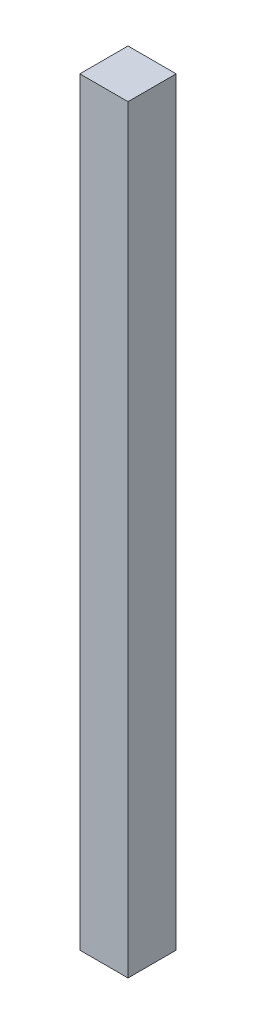
ISO-10303-21;
HEADER;
FILE_DESCRIPTION(('STEP AP214'),'2;1');
FILE_NAME('part.step','',(''),(''),'','','');
FILE_SCHEMA(('AUTOMOTIVE_DESIGN { 1 0 10303 214 1 1 1 1 }'));
ENDSEC;
DATA;
#1=APPLICATION_CONTEXT('core data for automotive mechanical design processes');
#2=APPLICATION_PROTOCOL_DEFINITION('international standard','automotive_design',2000,#1);
#3=PRODUCT_CONTEXT('',#1,'mechanical');
#4=PRODUCT('Part','Part','',(#3));
#5=PRODUCT_RELATED_PRODUCT_CATEGORY('part','',(#4));
#6=PRODUCT_DEFINITION_FORMATION('','',#4);
#7=PRODUCT_DEFINITION_CONTEXT('part definition',#1,'design');
#8=PRODUCT_DEFINITION('design','',#6,#7);
#9=PRODUCT_DEFINITION_SHAPE('','',#8);
#10=(LENGTH_UNIT() NAMED_UNIT(*) SI_UNIT(.MILLI.,.METRE.));
#11=(NAMED_UNIT(*) PLANE_ANGLE_UNIT() SI_UNIT($,.RADIAN.));
#12=(NAMED_UNIT(*) SI_UNIT($,.STERADIAN.) SOLID_ANGLE_UNIT());
#13=UNCERTAINTY_MEASURE_WITH_UNIT(LENGTH_MEASURE(1.E-05),#10,'distance_accuracy_value','');
#14=(GEOMETRIC_REPRESENTATION_CONTEXT(3) GLOBAL_UNCERTAINTY_ASSIGNED_CONTEXT((#13)) GLOBAL_UNIT_ASSIGNED_CONTEXT((#10,
#11,#12)) REPRESENTATION_CONTEXT('',''));
#15=CARTESIAN_POINT('',(0.,0.,0.));
#16=DIRECTION('',(0.,0.,1.));
#17=DIRECTION('',(1.,0.,0.));
#18=AXIS2_PLACEMENT_3D('',#15,#16,#17);
#19=CARTESIAN_POINT('',(-39.8355089835924,400.,-18.6136158048334));
#20=DIRECTION('',(1.,0.,0.));
#21=DIRECTION('',(0.,0.,-1.));
#22=AXIS2_PLACEMENT_3D('',#19,#20,#21);
#23=PLANE('',#22);
#24=DIRECTION('',(0.,0.,1.));
#25=VECTOR('',#24,1.);
#26=CARTESIAN_POINT('',(-39.8355089835924,0.,-18.6136158048334));
#27=LINE('',#26,#25);
#28=CARTESIAN_POINT('',(-39.8355089835924,0.,-18.6136158048334));
#29=VERTEX_POINT('',#28);
#30=CARTESIAN_POINT('',(-39.8355089835924,0.,6.78638419516663));
#31=VERTEX_POINT('',#30);
#32=EDGE_CURVE('E94',#29,#31,#27,.T.);
#33=ORIENTED_EDGE('',*,*,#32,.T.);
#34=DIRECTION('',(0.,-1.,0.));
#35=VECTOR('',#34,1.);
#36=CARTESIAN_POINT('',(-39.8355089835924,400.,6.78638419516663));
#37=LINE('',#36,#35);
#38=CARTESIAN_POINT('',(-39.8355089835924,400.,6.78638419516663));
#39=VERTEX_POINT('',#38);
#40=EDGE_CURVE('E11',#39,#31,#37,.T.);
#41=ORIENTED_EDGE('',*,*,#40,.F.);
#42=DIRECTION('',(0.,0.,1.));
#43=VECTOR('',#42,1.);
#44=CARTESIAN_POINT('',(-39.8355089835924,400.,-18.6136158048334));
#45=LINE('',#44,#43);
#46=CARTESIAN_POINT('',(-39.8355089835924,400.,-18.6136158048334));
#47=VERTEX_POINT('',#46);
#48=EDGE_CURVE('E82',#47,#39,#45,.T.);
#49=ORIENTED_EDGE('',*,*,#48,.F.);
#50=DIRECTION('',(0.,-1.,0.));
#51=VECTOR('',#50,1.);
#52=CARTESIAN_POINT('',(-39.8355089835924,400.,-18.6136158048334));
#53=LINE('',#52,#51);
#54=EDGE_CURVE('E90',#47,#29,#53,.T.);
#55=ORIENTED_EDGE('',*,*,#54,.T.);
#56=EDGE_LOOP('',(#33,#41,#49,#55));
#57=FACE_BOUND('',#56,.T.);
#58=ADVANCED_FACE('F31',(#57),#23,.F.);
#59=CARTESIAN_POINT('',(-39.8355089835924,400.,6.78638419516663));
#60=DIRECTION('',(0.,0.,-1.));
#61=DIRECTION('',(-1.,0.,0.));
#62=AXIS2_PLACEMENT_3D('',#59,#60,#61);
#63=PLANE('',#62);
#64=DIRECTION('',(1.,0.,0.));
#65=VECTOR('',#64,1.);
#66=CARTESIAN_POINT('',(-39.8355089835924,0.,6.78638419516663));
#67=LINE('',#66,#65);
#68=CARTESIAN_POINT('',(-14.4355089835924,0.,6.78638419516663));
#69=VERTEX_POINT('',#68);
#70=EDGE_CURVE('E86',#31,#69,#67,.T.);
#71=ORIENTED_EDGE('',*,*,#70,.T.);
#72=DIRECTION('',(0.,-1.,0.));
#73=VECTOR('',#72,1.);
#74=CARTESIAN_POINT('',(-14.4355089835924,400.,6.78638419516663));
#75=LINE('',#74,#73);
#76=CARTESIAN_POINT('',(-14.4355089835924,400.,6.78638419516663));
#77=VERTEX_POINT('',#76);
#78=EDGE_CURVE('E39',#77,#69,#75,.T.);
#79=ORIENTED_EDGE('',*,*,#78,.F.);
#80=DIRECTION('',(1.,0.,0.));
#81=VECTOR('',#80,1.);
#82=CARTESIAN_POINT('',(-39.8355089835924,400.,6.78638419516663));
#83=LINE('',#82,#81);
#84=EDGE_CURVE('E77',#39,#77,#83,.T.);
#85=ORIENTED_EDGE('',*,*,#84,.F.);
#86=ORIENTED_EDGE('',*,*,#40,.T.);
#87=EDGE_LOOP('',(#71,#79,#85,#86));
#88=FACE_BOUND('',#87,.T.);
#89=ADVANCED_FACE('F85',(#88),#63,.F.);
#90=CARTESIAN_POINT('',(-14.4355089835924,400.,-18.6136158048334));
#91=DIRECTION('',(-1.,0.,0.));
#92=DIRECTION('',(0.,0.,1.));
#93=AXIS2_PLACEMENT_3D('',#90,#91,#92);
#94=PLANE('',#93);
#95=DIRECTION('',(0.,0.,-1.));
#96=VECTOR('',#95,1.);
#97=CARTESIAN_POINT('',(-14.4355089835924,0.,-18.6136158048334));
#98=LINE('',#97,#96);
#99=CARTESIAN_POINT('',(-14.4355089835924,0.,-18.6136158048334));
#100=VERTEX_POINT('',#99);
#101=EDGE_CURVE('E64',#69,#100,#98,.T.);
#102=ORIENTED_EDGE('',*,*,#101,.T.);
#103=DIRECTION('',(0.,-1.,0.));
#104=VECTOR('',#103,1.);
#105=CARTESIAN_POINT('',(-14.4355089835924,400.,-18.6136158048334));
#106=LINE('',#105,#104);
#107=CARTESIAN_POINT('',(-14.4355089835924,400.,-18.6136158048334));
#108=VERTEX_POINT('',#107);
#109=EDGE_CURVE('E87',#108,#100,#106,.T.);
#110=ORIENTED_EDGE('',*,*,#109,.F.);
#111=DIRECTION('',(0.,0.,-1.));
#112=VECTOR('',#111,1.);
#113=CARTESIAN_POINT('',(-14.4355089835924,400.,-18.6136158048334));
#114=LINE('',#113,#112);
#115=EDGE_CURVE('E80',#77,#108,#114,.T.);
#116=ORIENTED_EDGE('',*,*,#115,.F.);
#117=ORIENTED_EDGE('',*,*,#78,.T.);
#118=EDGE_LOOP('',(#102,#110,#116,#117));
#119=FACE_BOUND('',#118,.T.);
#120=ADVANCED_FACE('F88',(#119),#94,.F.);
#121=CARTESIAN_POINT('',(-39.8355089835924,400.,-18.6136158048334));
#122=DIRECTION('',(0.,0.,1.));
#123=DIRECTION('',(1.,0.,0.));
#124=AXIS2_PLACEMENT_3D('',#121,#122,#123);
#125=PLANE('',#124);
#126=DIRECTION('',(-1.,0.,0.));
#127=VECTOR('',#126,1.);
#128=CARTESIAN_POINT('',(-39.8355089835924,0.,-18.6136158048334));
#129=LINE('',#128,#127);
#130=EDGE_CURVE('E70',#100,#29,#129,.T.);
#131=ORIENTED_EDGE('',*,*,#130,.T.);
#132=ORIENTED_EDGE('',*,*,#54,.F.);
#133=DIRECTION('',(-1.,0.,0.));
#134=VECTOR('',#133,1.);
#135=CARTESIAN_POINT('',(-39.8355089835924,400.,-18.6136158048334));
#136=LINE('',#135,#134);
#137=EDGE_CURVE('E47',#108,#47,#136,.T.);
#138=ORIENTED_EDGE('',*,*,#137,.F.);
#139=ORIENTED_EDGE('',*,*,#109,.T.);
#140=EDGE_LOOP('',(#131,#132,#138,#139));
#141=FACE_BOUND('',#140,.T.);
#142=ADVANCED_FACE('F101',(#141),#125,.F.);
#143=CARTESIAN_POINT('',(-39.8355089835924,400.,6.78638419516663));
#144=DIRECTION('',(0.,1.,0.));
#145=DIRECTION('',(0.,0.,1.));
#146=AXIS2_PLACEMENT_3D('',#143,#144,#145);
#147=PLANE('',#146);
#148=ORIENTED_EDGE('',*,*,#48,.T.);
#149=ORIENTED_EDGE('',*,*,#84,.T.);
#150=ORIENTED_EDGE('',*,*,#115,.T.);
#151=ORIENTED_EDGE('',*,*,#137,.T.);
#152=EDGE_LOOP('',(#148,#149,#150,#151));
#153=FACE_BOUND('',#152,.T.);
#154=ADVANCED_FACE('F78',(#153),#147,.T.);
#155=CARTESIAN_POINT('',(-39.8355089835924,0.,6.78638419516663));
#156=DIRECTION('',(0.,1.,0.));
#157=DIRECTION('',(0.,0.,1.));
#158=AXIS2_PLACEMENT_3D('',#155,#156,#157);
#159=PLANE('',#158);
#160=ORIENTED_EDGE('',*,*,#32,.F.);
#161=ORIENTED_EDGE('',*,*,#130,.F.);
#162=ORIENTED_EDGE('',*,*,#101,.F.);
#163=ORIENTED_EDGE('',*,*,#70,.F.);
#164=EDGE_LOOP('',(#160,#161,#162,#163));
#165=FACE_BOUND('',#164,.T.);
#166=ADVANCED_FACE('F104',(#165),#159,.F.);
#167=CLOSED_SHELL('',(#58,#89,#120,#142,#154,#166));
#168=MANIFOLD_SOLID_BREP('B2',#167);
#169=ADVANCED_BREP_SHAPE_REPRESENTATION('',(#18,#168),#14);
#170=SHAPE_DEFINITION_REPRESENTATION(#9,#169);
ENDSEC;
END-ISO-10303-21;
